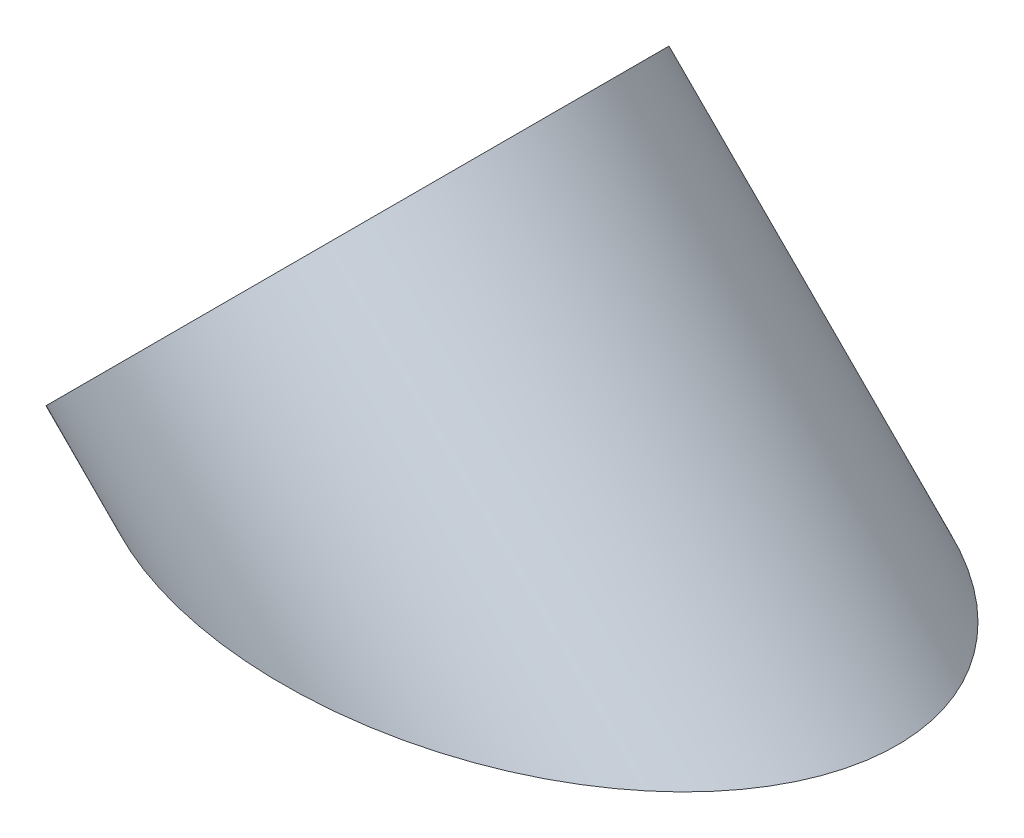
ISO-10303-21;
HEADER;
FILE_DESCRIPTION(('STEP AP214'),'2;1');
FILE_NAME('part.step','',(''),(''),'','','');
FILE_SCHEMA(('AUTOMOTIVE_DESIGN { 1 0 10303 214 1 1 1 1 }'));
ENDSEC;
DATA;
#1=APPLICATION_CONTEXT('core data for automotive mechanical design processes');
#2=APPLICATION_PROTOCOL_DEFINITION('international standard','automotive_design',2000,#1);
#3=PRODUCT_CONTEXT('',#1,'mechanical');
#4=PRODUCT('Part','Part','',(#3));
#5=PRODUCT_RELATED_PRODUCT_CATEGORY('part','',(#4));
#6=PRODUCT_DEFINITION_FORMATION('','',#4);
#7=PRODUCT_DEFINITION_CONTEXT('part definition',#1,'design');
#8=PRODUCT_DEFINITION('design','',#6,#7);
#9=PRODUCT_DEFINITION_SHAPE('','',#8);
#10=(LENGTH_UNIT() NAMED_UNIT(*) SI_UNIT(.MILLI.,.METRE.));
#11=(NAMED_UNIT(*) PLANE_ANGLE_UNIT() SI_UNIT($,.RADIAN.));
#12=(NAMED_UNIT(*) SI_UNIT($,.STERADIAN.) SOLID_ANGLE_UNIT());
#13=UNCERTAINTY_MEASURE_WITH_UNIT(LENGTH_MEASURE(1.E-05),#10,'distance_accuracy_value','');
#14=(GEOMETRIC_REPRESENTATION_CONTEXT(3) GLOBAL_UNCERTAINTY_ASSIGNED_CONTEXT((#13)) GLOBAL_UNIT_ASSIGNED_CONTEXT((#10,
#11,#12)) REPRESENTATION_CONTEXT('',''));
#15=CARTESIAN_POINT('',(0.,0.,0.));
#16=DIRECTION('',(0.,0.,1.));
#17=DIRECTION('',(1.,0.,0.));
#18=AXIS2_PLACEMENT_3D('',#15,#16,#17);
#19=CARTESIAN_POINT('',(35.3553390593274,-35.3553390593274,0.));
#20=DIRECTION('',(-0.707106781186547,0.707106781186548,0.));
#21=DIRECTION('',(-0.707106781186548,-0.707106781186547,0.));
#22=AXIS2_PLACEMENT_3D('',#19,#20,#21);
#23=CYLINDRICAL_SURFACE('',#22,25.);
#24=CARTESIAN_POINT('',(0.,0.,0.));
#25=DIRECTION('',(-0.707106781186547,0.707106781186548,0.));
#26=DIRECTION('',(-0.707106781186548,-0.707106781186547,0.));
#27=AXIS2_PLACEMENT_3D('',#24,#25,#26);
#28=CIRCLE('',#27,25.);
#29=CARTESIAN_POINT('',(-17.6776695296637,-17.6776695296637,0.));
#30=VERTEX_POINT('',#29);
#31=EDGE_CURVE('E11',#30,#30,#28,.T.);
#32=ORIENTED_EDGE('',*,*,#31,.F.);
#33=CARTESIAN_POINT('',(17.6776695296637,-17.6776695296637,0.));
#34=DIRECTION('',(0.,-1.,0.));
#35=DIRECTION('',(-1.,0.,0.));
#36=AXIS2_PLACEMENT_3D('',#33,#34,#35);
#37=ELLIPSE('',#36,35.3553390593274,25.);
#38=EDGE_CURVE('E43',#30,#30,#37,.F.);
#39=ORIENTED_EDGE('',*,*,#38,.T.);
#40=EDGE_LOOP('',(#32,#39));
#41=FACE_BOUND('',#40,.T.);
#42=ADVANCED_FACE('F36',(#41),#23,.T.);
#43=CARTESIAN_POINT('',(0.,0.,0.));
#44=DIRECTION('',(-0.707106781186547,0.707106781186548,0.));
#45=DIRECTION('',(-0.707106781186548,-0.707106781186547,0.));
#46=AXIS2_PLACEMENT_3D('',#43,#44,#45);
#47=PLANE('',#46);
#48=CARTESIAN_POINT('',(0.,0.,0.));
#49=DIRECTION('',(-0.707106781186547,0.707106781186548,0.));
#50=DIRECTION('',(-0.707106781186548,-0.707106781186547,0.));
#51=AXIS2_PLACEMENT_3D('',#48,#49,#50);
#52=CIRCLE('',#51,10.);
#53=CARTESIAN_POINT('',(-7.07106781186548,-7.07106781186547,0.));
#54=VERTEX_POINT('',#53);
#55=EDGE_CURVE('E39',#54,#54,#52,.T.);
#56=ORIENTED_EDGE('',*,*,#55,.F.);
#57=EDGE_LOOP('',(#56));
#58=FACE_BOUND('',#57,.T.);
#59=ORIENTED_EDGE('',*,*,#31,.T.);
#60=EDGE_LOOP('',(#59));
#61=FACE_BOUND('',#60,.T.);
#62=ADVANCED_FACE('F56',(#58,#61),#47,.T.);
#63=CARTESIAN_POINT('',(53.0330085889911,-17.6776695296637,50.));
#64=DIRECTION('',(0.,-1.,0.));
#65=DIRECTION('',(1.,0.,0.));
#66=AXIS2_PLACEMENT_3D('',#63,#64,#65);
#67=PLANE('',#66);
#68=ORIENTED_EDGE('',*,*,#38,.F.);
#69=EDGE_LOOP('',(#68));
#70=FACE_BOUND('',#69,.T.);
#71=ADVANCED_FACE('F47',(#70),#67,.T.);
#72=CARTESIAN_POINT('',(0.,0.,0.));
#73=DIRECTION('',(0.707106781186548,0.707106781186548,0.));
#74=DIRECTION('',(0.,0.,1.));
#75=AXIS2_PLACEMENT_3D('',#72,#73,#74);
#76=SPHERICAL_SURFACE('',#75,10.);
#77=CARTESIAN_POINT('',(0.,0.,0.));
#78=DIRECTION('',(-0.707106781186547,0.707106781186548,0.));
#79=DIRECTION('',(-0.707106781186548,-0.707106781186547,0.));
#80=AXIS2_PLACEMENT_3D('',#77,#78,#79);
#81=SPHERICAL_SURFACE('',#80,10.);
#82=ORIENTED_EDGE('',*,*,#55,.T.);
#83=EDGE_LOOP('',(#82));
#84=FACE_BOUND('',#83,.T.);
#85=ADVANCED_FACE('F54',(#84),#81,.F.);
#86=CLOSED_SHELL('',(#42,#62,#71,#85));
#87=MANIFOLD_SOLID_BREP('B2',#86);
#88=ADVANCED_BREP_SHAPE_REPRESENTATION('',(#18,#87),#14);
#89=SHAPE_DEFINITION_REPRESENTATION(#9,#88);
ENDSEC;
END-ISO-10303-21;
